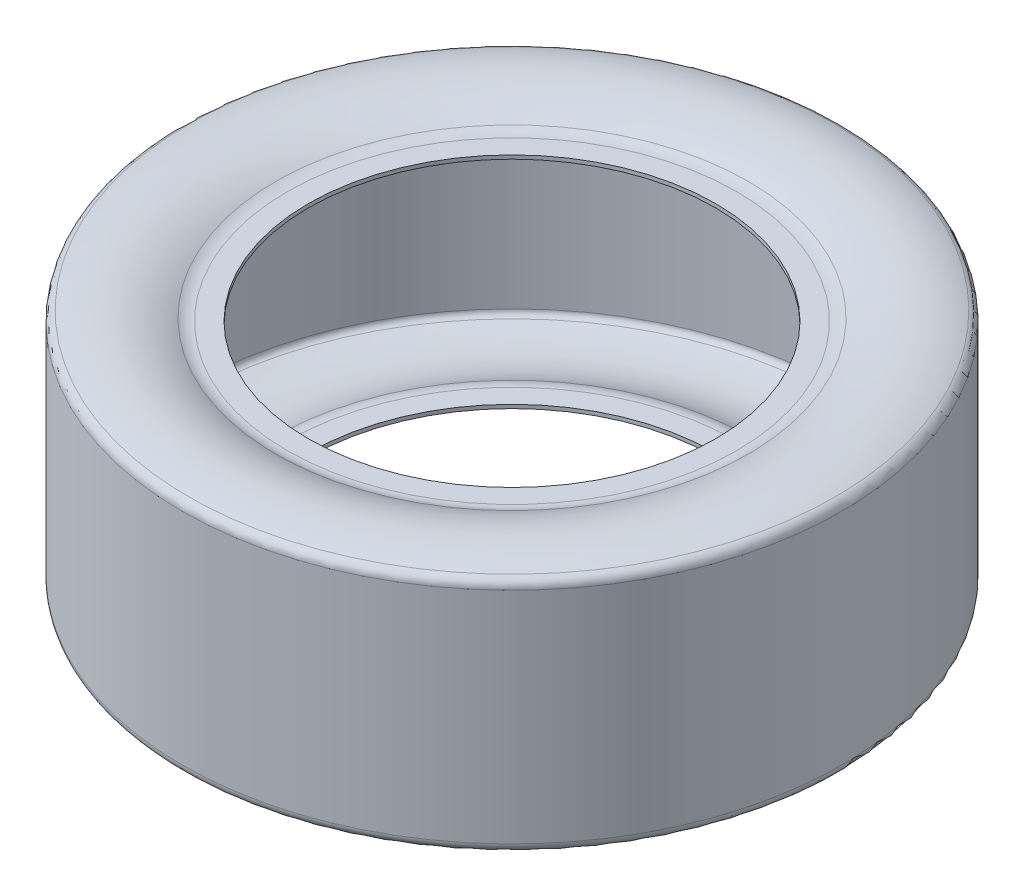
ISO-10303-21;
HEADER;
FILE_DESCRIPTION(('STEP AP214'),'2;1');
FILE_NAME('part.step','',(''),(''),'','','');
FILE_SCHEMA(('AUTOMOTIVE_DESIGN { 1 0 10303 214 1 1 1 1 }'));
ENDSEC;
DATA;
#1=APPLICATION_CONTEXT('core data for automotive mechanical design processes');
#2=APPLICATION_PROTOCOL_DEFINITION('international standard','automotive_design',2000,#1);
#3=PRODUCT_CONTEXT('',#1,'mechanical');
#4=PRODUCT('Part','Part','',(#3));
#5=PRODUCT_RELATED_PRODUCT_CATEGORY('part','',(#4));
#6=PRODUCT_DEFINITION_FORMATION('','',#4);
#7=PRODUCT_DEFINITION_CONTEXT('part definition',#1,'design');
#8=PRODUCT_DEFINITION('design','',#6,#7);
#9=PRODUCT_DEFINITION_SHAPE('','',#8);
#10=(LENGTH_UNIT() NAMED_UNIT(*) SI_UNIT(.MILLI.,.METRE.));
#11=(NAMED_UNIT(*) PLANE_ANGLE_UNIT() SI_UNIT($,.RADIAN.));
#12=(NAMED_UNIT(*) SI_UNIT($,.STERADIAN.) SOLID_ANGLE_UNIT());
#13=UNCERTAINTY_MEASURE_WITH_UNIT(LENGTH_MEASURE(1.E-05),#10,'distance_accuracy_value','');
#14=(GEOMETRIC_REPRESENTATION_CONTEXT(3) GLOBAL_UNCERTAINTY_ASSIGNED_CONTEXT((#13)) GLOBAL_UNIT_ASSIGNED_CONTEXT((#10,
#11,#12)) REPRESENTATION_CONTEXT('',''));
#15=CARTESIAN_POINT('',(0.,0.,0.));
#16=DIRECTION('',(0.,0.,1.));
#17=DIRECTION('',(1.,0.,0.));
#18=AXIS2_PLACEMENT_3D('',#15,#16,#17);
#19=CARTESIAN_POINT('',(0.,-44.45,0.));
#20=DIRECTION('',(0.,1.,0.));
#21=DIRECTION('',(0.,0.,-1.));
#22=AXIS2_PLACEMENT_3D('',#19,#20,#21);
#23=CYLINDRICAL_SURFACE('',#22,263.7);
#24=CARTESIAN_POINT('',(0.,-88.9,0.));
#25=DIRECTION('',(0.,-1.,0.));
#26=DIRECTION('',(0.,0.,-1.));
#27=AXIS2_PLACEMENT_3D('',#24,#25,#26);
#28=CIRCLE('',#27,263.7);
#29=CARTESIAN_POINT('',(0.,-88.9,-263.7));
#30=VERTEX_POINT('',#29);
#31=EDGE_CURVE('E261',#30,#30,#28,.F.);
#32=ORIENTED_EDGE('',*,*,#31,.F.);
#33=EDGE_LOOP('',(#32));
#34=FACE_BOUND('',#33,.T.);
#35=CARTESIAN_POINT('',(0.,88.9,0.));
#36=DIRECTION('',(0.,-1.,0.));
#37=DIRECTION('',(0.,0.,-1.));
#38=AXIS2_PLACEMENT_3D('',#35,#36,#37);
#39=CIRCLE('',#38,263.7);
#40=CARTESIAN_POINT('',(0.,88.9,-263.7));
#41=VERTEX_POINT('',#40);
#42=EDGE_CURVE('E258',#41,#41,#39,.T.);
#43=ORIENTED_EDGE('',*,*,#42,.F.);
#44=EDGE_LOOP('',(#43));
#45=FACE_BOUND('',#44,.T.);
#46=ADVANCED_FACE('F35',(#34,#45),#23,.F.);
#47=CARTESIAN_POINT('',(0.,-88.9,0.));
#48=DIRECTION('',(0.,1.,0.));
#49=DIRECTION('',(0.,0.,-1.));
#50=AXIS2_PLACEMENT_3D('',#47,#48,#49);
#51=TOROIDAL_SURFACE('',#50,258.7,4.99999999999994);
#52=ORIENTED_EDGE('',*,*,#31,.T.);
#53=EDGE_LOOP('',(#52));
#54=FACE_BOUND('',#53,.T.);
#55=CARTESIAN_POINT('',(0.,-93.5989720176161,0.));
#56=DIRECTION('',(0.,-1.,0.));
#57=DIRECTION('',(0.,0.,-1.));
#58=AXIS2_PLACEMENT_3D('',#55,#56,#57);
#59=CIRCLE('',#58,260.408701839895);
#60=CARTESIAN_POINT('',(0.,-93.5989720176161,-260.408701839895));
#61=VERTEX_POINT('',#60);
#62=EDGE_CURVE('E239',#61,#61,#59,.F.);
#63=ORIENTED_EDGE('',*,*,#62,.F.);
#64=EDGE_LOOP('',(#63));
#65=FACE_BOUND('',#64,.T.);
#66=ADVANCED_FACE('F252',(#54,#65),#51,.F.);
#67=CARTESIAN_POINT('',(0.,88.9,0.));
#68=DIRECTION('',(0.,1.,0.));
#69=DIRECTION('',(0.,0.,-1.));
#70=AXIS2_PLACEMENT_3D('',#67,#68,#69);
#71=TOROIDAL_SURFACE('',#70,258.7,4.99999999999994);
#72=CARTESIAN_POINT('',(0.,93.5989720176161,0.));
#73=DIRECTION('',(0.,-1.,0.));
#74=DIRECTION('',(0.,0.,-1.));
#75=AXIS2_PLACEMENT_3D('',#72,#73,#74);
#76=CIRCLE('',#75,260.408701839895);
#77=CARTESIAN_POINT('',(0.,93.5989720176161,-260.408701839895));
#78=VERTEX_POINT('',#77);
#79=EDGE_CURVE('E236',#78,#78,#76,.T.);
#80=ORIENTED_EDGE('',*,*,#79,.F.);
#81=EDGE_LOOP('',(#80));
#82=FACE_BOUND('',#81,.T.);
#83=ORIENTED_EDGE('',*,*,#42,.T.);
#84=EDGE_LOOP('',(#83));
#85=FACE_BOUND('',#84,.T.);
#86=ADVANCED_FACE('F248',(#82,#85),#71,.F.);
#87=CARTESIAN_POINT('',(0.,-15.5341676680611,0.));
#88=DIRECTION('',(0.,1.,0.));
#89=DIRECTION('',(0.,0.,-1.));
#90=AXIS2_PLACEMENT_3D('',#87,#88,#89);
#91=TOROIDAL_SURFACE('',#90,232.021753732297,83.0658323319388);
#92=ORIENTED_EDGE('',*,*,#62,.T.);
#93=EDGE_LOOP('',(#92));
#94=FACE_BOUND('',#93,.T.);
#95=CARTESIAN_POINT('',(0.,-88.6539500098942,0.));
#96=DIRECTION('',(0.,-1.,0.));
#97=DIRECTION('',(0.,0.,-1.));
#98=AXIS2_PLACEMENT_3D('',#95,#96,#97);
#99=CIRCLE('',#98,192.608178262914);
#100=CARTESIAN_POINT('',(0.,-88.6539500098942,-192.608178262914));
#101=VERTEX_POINT('',#100);
#102=EDGE_CURVE('E200',#101,#101,#99,.T.);
#103=ORIENTED_EDGE('',*,*,#102,.T.);
#104=EDGE_LOOP('',(#103));
#105=FACE_BOUND('',#104,.T.);
#106=ADVANCED_FACE('F245',(#94,#105),#91,.F.);
#107=CARTESIAN_POINT('',(0.,15.5341676680611,0.));
#108=DIRECTION('',(0.,1.,0.));
#109=DIRECTION('',(0.,0.,-1.));
#110=AXIS2_PLACEMENT_3D('',#107,#108,#109);
#111=TOROIDAL_SURFACE('',#110,232.021753732297,83.0658323319388);
#112=CARTESIAN_POINT('',(0.,88.6539500098942,0.));
#113=DIRECTION('',(0.,-1.,0.));
#114=DIRECTION('',(0.,0.,-1.));
#115=AXIS2_PLACEMENT_3D('',#112,#113,#114);
#116=CIRCLE('',#115,192.608178262914);
#117=CARTESIAN_POINT('',(0.,88.6539500098942,-192.608178262914));
#118=VERTEX_POINT('',#117);
#119=EDGE_CURVE('E196',#118,#118,#116,.F.);
#120=ORIENTED_EDGE('',*,*,#119,.T.);
#121=EDGE_LOOP('',(#120));
#122=FACE_BOUND('',#121,.T.);
#123=ORIENTED_EDGE('',*,*,#79,.T.);
#124=EDGE_LOOP('',(#123));
#125=FACE_BOUND('',#124,.T.);
#126=ADVANCED_FACE('F220',(#122,#125),#111,.F.);
#127=CARTESIAN_POINT('',(0.,-108.9,0.));
#128=DIRECTION('',(0.,1.,0.));
#129=DIRECTION('',(0.,0.,-1.));
#130=AXIS2_PLACEMENT_3D('',#127,#128,#129);
#131=TOROIDAL_SURFACE('',#130,181.695,23.0000000000001);
#132=ORIENTED_EDGE('',*,*,#102,.F.);
#133=EDGE_LOOP('',(#132));
#134=FACE_BOUND('',#133,.T.);
#135=CARTESIAN_POINT('',(0.,-85.8999999999999,0.));
#136=DIRECTION('',(0.,-1.,0.));
#137=DIRECTION('',(0.,0.,1.));
#138=AXIS2_PLACEMENT_3D('',#135,#136,#137);
#139=CIRCLE('',#138,181.695000000036);
#140=CARTESIAN_POINT('',(0.,-85.8999999999999,181.695000000036));
#141=VERTEX_POINT('',#140);
#142=EDGE_CURVE('E199',#141,#141,#139,.T.);
#143=ORIENTED_EDGE('',*,*,#142,.T.);
#144=EDGE_LOOP('',(#143));
#145=FACE_BOUND('',#144,.T.);
#146=ADVANCED_FACE('F216',(#134,#145),#131,.T.);
#147=CARTESIAN_POINT('',(0.,108.9,0.));
#148=DIRECTION('',(0.,1.,0.));
#149=DIRECTION('',(0.,0.,-1.));
#150=AXIS2_PLACEMENT_3D('',#147,#148,#149);
#151=TOROIDAL_SURFACE('',#150,181.695,23.0000000000001);
#152=CARTESIAN_POINT('',(0.,85.8999999999999,0.));
#153=DIRECTION('',(0.,1.,0.));
#154=DIRECTION('',(0.,0.,1.));
#155=AXIS2_PLACEMENT_3D('',#152,#153,#154);
#156=CIRCLE('',#155,181.695000000036);
#157=CARTESIAN_POINT('',(0.,85.8999999999999,181.695000000036));
#158=VERTEX_POINT('',#157);
#159=EDGE_CURVE('E160',#158,#158,#156,.T.);
#160=ORIENTED_EDGE('',*,*,#159,.T.);
#161=EDGE_LOOP('',(#160));
#162=FACE_BOUND('',#161,.T.);
#163=ORIENTED_EDGE('',*,*,#119,.F.);
#164=EDGE_LOOP('',(#163));
#165=FACE_BOUND('',#164,.T.);
#166=ADVANCED_FACE('F182',(#162,#165),#151,.T.);
#167=CARTESIAN_POINT('',(0.,-85.8999999999999,164.825));
#168=DIRECTION('',(0.,1.,0.));
#169=DIRECTION('',(0.,0.,-1.));
#170=AXIS2_PLACEMENT_3D('',#167,#168,#169);
#171=PLANE('',#170);
#172=CARTESIAN_POINT('',(0.,-85.8999999999999,0.));
#173=DIRECTION('',(0.,-1.,0.));
#174=DIRECTION('',(0.,0.,-1.));
#175=AXIS2_PLACEMENT_3D('',#172,#173,#174);
#176=CIRCLE('',#175,164.825);
#177=CARTESIAN_POINT('',(0.,-85.8999999999999,-164.825));
#178=VERTEX_POINT('',#177);
#179=EDGE_CURVE('E38',#178,#178,#176,.F.);
#180=ORIENTED_EDGE('',*,*,#179,.F.);
#181=EDGE_LOOP('',(#180));
#182=FACE_BOUND('',#181,.T.);
#183=ORIENTED_EDGE('',*,*,#142,.F.);
#184=EDGE_LOOP('',(#183));
#185=FACE_BOUND('',#184,.T.);
#186=ADVANCED_FACE('F177',(#182,#185),#171,.T.);
#187=CARTESIAN_POINT('',(0.,85.9,181.695000000036));
#188=DIRECTION('',(0.,-1.,0.));
#189=DIRECTION('',(0.,0.,1.));
#190=AXIS2_PLACEMENT_3D('',#187,#188,#189);
#191=PLANE('',#190);
#192=CARTESIAN_POINT('',(0.,85.8999999999999,0.));
#193=DIRECTION('',(0.,-1.,0.));
#194=DIRECTION('',(0.,0.,-1.));
#195=AXIS2_PLACEMENT_3D('',#192,#193,#194);
#196=CIRCLE('',#195,164.825);
#197=CARTESIAN_POINT('',(0.,85.8999999999999,-164.825));
#198=VERTEX_POINT('',#197);
#199=EDGE_CURVE('E274',#198,#198,#196,.T.);
#200=ORIENTED_EDGE('',*,*,#199,.F.);
#201=EDGE_LOOP('',(#200));
#202=FACE_BOUND('',#201,.T.);
#203=ORIENTED_EDGE('',*,*,#159,.F.);
#204=EDGE_LOOP('',(#203));
#205=FACE_BOUND('',#204,.T.);
#206=ADVANCED_FACE('F167',(#202,#205),#191,.T.);
#207=CARTESIAN_POINT('',(0.,-87.3999999999999,0.));
#208=DIRECTION('',(0.,1.,0.));
#209=DIRECTION('',(0.,0.,-1.));
#210=AXIS2_PLACEMENT_3D('',#207,#208,#209);
#211=CYLINDRICAL_SURFACE('',#210,164.825);
#212=ORIENTED_EDGE('',*,*,#179,.T.);
#213=EDGE_LOOP('',(#212));
#214=FACE_BOUND('',#213,.T.);
#215=CARTESIAN_POINT('',(0.,-88.9,0.));
#216=DIRECTION('',(0.,-1.,0.));
#217=DIRECTION('',(0.,0.,-1.));
#218=AXIS2_PLACEMENT_3D('',#215,#216,#217);
#219=CIRCLE('',#218,164.825);
#220=CARTESIAN_POINT('',(0.,-88.9,-164.825));
#221=VERTEX_POINT('',#220);
#222=EDGE_CURVE('E272',#221,#221,#219,.T.);
#223=ORIENTED_EDGE('',*,*,#222,.T.);
#224=EDGE_LOOP('',(#223));
#225=FACE_BOUND('',#224,.T.);
#226=ADVANCED_FACE('F176',(#214,#225),#211,.F.);
#227=CARTESIAN_POINT('',(0.,87.3999999999999,0.));
#228=DIRECTION('',(0.,1.,0.));
#229=DIRECTION('',(0.,0.,-1.));
#230=AXIS2_PLACEMENT_3D('',#227,#228,#229);
#231=CYLINDRICAL_SURFACE('',#230,164.825);
#232=CARTESIAN_POINT('',(0.,88.9,0.));
#233=DIRECTION('',(0.,-1.,0.));
#234=DIRECTION('',(0.,0.,-1.));
#235=AXIS2_PLACEMENT_3D('',#232,#233,#234);
#236=CIRCLE('',#235,164.825);
#237=CARTESIAN_POINT('',(0.,88.9,-164.825));
#238=VERTEX_POINT('',#237);
#239=EDGE_CURVE('E269',#238,#238,#236,.F.);
#240=ORIENTED_EDGE('',*,*,#239,.T.);
#241=EDGE_LOOP('',(#240));
#242=FACE_BOUND('',#241,.T.);
#243=ORIENTED_EDGE('',*,*,#199,.T.);
#244=EDGE_LOOP('',(#243));
#245=FACE_BOUND('',#244,.T.);
#246=ADVANCED_FACE('F130',(#242,#245),#231,.F.);
#247=CARTESIAN_POINT('',(0.,-88.9,181.695));
#248=DIRECTION('',(0.,-1.,0.));
#249=DIRECTION('',(0.,0.,1.));
#250=AXIS2_PLACEMENT_3D('',#247,#248,#249);
#251=PLANE('',#250);
#252=ORIENTED_EDGE('',*,*,#222,.F.);
#253=EDGE_LOOP('',(#252));
#254=FACE_BOUND('',#253,.T.);
#255=CARTESIAN_POINT('',(0.,-88.9,0.));
#256=DIRECTION('',(0.,1.,0.));
#257=DIRECTION('',(0.,0.,1.));
#258=AXIS2_PLACEMENT_3D('',#255,#256,#257);
#259=CIRCLE('',#258,181.695);
#260=CARTESIAN_POINT('',(0.,-88.9,181.695));
#261=VERTEX_POINT('',#260);
#262=EDGE_CURVE('E147',#261,#261,#259,.T.);
#263=ORIENTED_EDGE('',*,*,#262,.F.);
#264=EDGE_LOOP('',(#263));
#265=FACE_BOUND('',#264,.T.);
#266=ADVANCED_FACE('F125',(#254,#265),#251,.T.);
#267=CARTESIAN_POINT('',(0.,88.9,164.825));
#268=DIRECTION('',(0.,1.,0.));
#269=DIRECTION('',(0.,0.,-1.));
#270=AXIS2_PLACEMENT_3D('',#267,#268,#269);
#271=PLANE('',#270);
#272=ORIENTED_EDGE('',*,*,#239,.F.);
#273=EDGE_LOOP('',(#272));
#274=FACE_BOUND('',#273,.T.);
#275=CARTESIAN_POINT('',(0.,88.9,0.));
#276=DIRECTION('',(0.,-1.,0.));
#277=DIRECTION('',(0.,0.,1.));
#278=AXIS2_PLACEMENT_3D('',#275,#276,#277);
#279=CIRCLE('',#278,181.695);
#280=CARTESIAN_POINT('',(0.,88.9,181.695));
#281=VERTEX_POINT('',#280);
#282=EDGE_CURVE('E112',#281,#281,#279,.T.);
#283=ORIENTED_EDGE('',*,*,#282,.F.);
#284=EDGE_LOOP('',(#283));
#285=FACE_BOUND('',#284,.T.);
#286=ADVANCED_FACE('F116',(#274,#285),#271,.T.);
#287=CARTESIAN_POINT('',(0.,-108.9,0.));
#288=DIRECTION('',(0.,1.,0.));
#289=DIRECTION('',(0.,0.,-1.));
#290=AXIS2_PLACEMENT_3D('',#287,#288,#289);
#291=TOROIDAL_SURFACE('',#290,181.695,20.);
#292=ORIENTED_EDGE('',*,*,#262,.T.);
#293=EDGE_LOOP('',(#292));
#294=FACE_BOUND('',#293,.T.);
#295=CARTESIAN_POINT('',(0.,-91.2947391390385,0.));
#296=DIRECTION('',(0.,-1.,0.));
#297=DIRECTION('',(0.,0.,-1.));
#298=AXIS2_PLACEMENT_3D('',#295,#296,#297);
#299=CIRCLE('',#298,191.184720228621);
#300=CARTESIAN_POINT('',(0.,-91.2947391390385,-191.184720228621));
#301=VERTEX_POINT('',#300);
#302=EDGE_CURVE('E83',#301,#301,#299,.T.);
#303=ORIENTED_EDGE('',*,*,#302,.T.);
#304=EDGE_LOOP('',(#303));
#305=FACE_BOUND('',#304,.T.);
#306=ADVANCED_FACE('F98',(#294,#305),#291,.F.);
#307=CARTESIAN_POINT('',(0.,108.9,0.));
#308=DIRECTION('',(0.,1.,0.));
#309=DIRECTION('',(0.,0.,-1.));
#310=AXIS2_PLACEMENT_3D('',#307,#308,#309);
#311=TOROIDAL_SURFACE('',#310,181.695,20.);
#312=CARTESIAN_POINT('',(0.,91.2947391390385,0.));
#313=DIRECTION('',(0.,-1.,0.));
#314=DIRECTION('',(0.,0.,-1.));
#315=AXIS2_PLACEMENT_3D('',#312,#313,#314);
#316=CIRCLE('',#315,191.184720228621);
#317=CARTESIAN_POINT('',(0.,91.2947391390385,-191.184720228621));
#318=VERTEX_POINT('',#317);
#319=EDGE_CURVE('E77',#318,#318,#316,.F.);
#320=ORIENTED_EDGE('',*,*,#319,.T.);
#321=EDGE_LOOP('',(#320));
#322=FACE_BOUND('',#321,.T.);
#323=ORIENTED_EDGE('',*,*,#282,.T.);
#324=EDGE_LOOP('',(#323));
#325=FACE_BOUND('',#324,.T.);
#326=ADVANCED_FACE('F92',(#322,#325),#311,.F.);
#327=CARTESIAN_POINT('',(0.,-15.5341676680611,0.));
#328=DIRECTION('',(0.,1.,0.));
#329=DIRECTION('',(0.,0.,-1.));
#330=AXIS2_PLACEMENT_3D('',#327,#328,#329);
#331=TOROIDAL_SURFACE('',#330,232.021753732297,86.0658323319389);
#332=ORIENTED_EDGE('',*,*,#302,.F.);
#333=EDGE_LOOP('',(#332));
#334=FACE_BOUND('',#333,.T.);
#335=CARTESIAN_POINT('',(0.,-96.4183552281858,0.));
#336=DIRECTION('',(0.,-1.,0.));
#337=DIRECTION('',(0.,0.,-1.));
#338=AXIS2_PLACEMENT_3D('',#335,#336,#337);
#339=CIRCLE('',#338,261.433922943832);
#340=CARTESIAN_POINT('',(0.,-96.4183552281858,-261.433922943832));
#341=VERTEX_POINT('',#340);
#342=EDGE_CURVE('E74',#341,#341,#339,.T.);
#343=ORIENTED_EDGE('',*,*,#342,.T.);
#344=EDGE_LOOP('',(#343));
#345=FACE_BOUND('',#344,.T.);
#346=ADVANCED_FACE('F89',(#334,#345),#331,.T.);
#347=CARTESIAN_POINT('',(0.,15.5341676680611,0.));
#348=DIRECTION('',(0.,1.,0.));
#349=DIRECTION('',(0.,0.,-1.));
#350=AXIS2_PLACEMENT_3D('',#347,#348,#349);
#351=TOROIDAL_SURFACE('',#350,232.021753732297,86.0658323319389);
#352=CARTESIAN_POINT('',(0.,96.4183552281858,0.));
#353=DIRECTION('',(0.,-1.,0.));
#354=DIRECTION('',(0.,0.,-1.));
#355=AXIS2_PLACEMENT_3D('',#352,#353,#354);
#356=CIRCLE('',#355,261.433922943832);
#357=CARTESIAN_POINT('',(0.,96.4183552281858,-261.433922943832));
#358=VERTEX_POINT('',#357);
#359=EDGE_CURVE('E47',#358,#358,#356,.F.);
#360=ORIENTED_EDGE('',*,*,#359,.T.);
#361=EDGE_LOOP('',(#360));
#362=FACE_BOUND('',#361,.T.);
#363=ORIENTED_EDGE('',*,*,#319,.F.);
#364=EDGE_LOOP('',(#363));
#365=FACE_BOUND('',#364,.T.);
#366=ADVANCED_FACE('F67',(#362,#365),#351,.T.);
#367=CARTESIAN_POINT('',(0.,-88.9,0.));
#368=DIRECTION('',(0.,1.,0.));
#369=DIRECTION('',(0.,0.,-1.));
#370=AXIS2_PLACEMENT_3D('',#367,#368,#369);
#371=TOROIDAL_SURFACE('',#370,258.7,8.);
#372=ORIENTED_EDGE('',*,*,#342,.F.);
#373=EDGE_LOOP('',(#372));
#374=FACE_BOUND('',#373,.T.);
#375=CARTESIAN_POINT('',(0.,-88.9,0.));
#376=DIRECTION('',(0.,-1.,0.));
#377=DIRECTION('',(0.,0.,-1.));
#378=AXIS2_PLACEMENT_3D('',#375,#376,#377);
#379=CIRCLE('',#378,266.7);
#380=CARTESIAN_POINT('',(0.,-88.9,-266.7));
#381=VERTEX_POINT('',#380);
#382=EDGE_CURVE('E42',#381,#381,#379,.T.);
#383=ORIENTED_EDGE('',*,*,#382,.T.);
#384=EDGE_LOOP('',(#383));
#385=FACE_BOUND('',#384,.T.);
#386=ADVANCED_FACE('F63',(#374,#385),#371,.T.);
#387=CARTESIAN_POINT('',(0.,88.9,0.));
#388=DIRECTION('',(0.,1.,0.));
#389=DIRECTION('',(0.,0.,-1.));
#390=AXIS2_PLACEMENT_3D('',#387,#388,#389);
#391=TOROIDAL_SURFACE('',#390,258.7,8.);
#392=CARTESIAN_POINT('',(0.,88.9,0.));
#393=DIRECTION('',(0.,-1.,0.));
#394=DIRECTION('',(0.,0.,-1.));
#395=AXIS2_PLACEMENT_3D('',#392,#393,#394);
#396=CIRCLE('',#395,266.7);
#397=CARTESIAN_POINT('',(0.,88.9,-266.7));
#398=VERTEX_POINT('',#397);
#399=EDGE_CURVE('E10',#398,#398,#396,.F.);
#400=ORIENTED_EDGE('',*,*,#399,.T.);
#401=EDGE_LOOP('',(#400));
#402=FACE_BOUND('',#401,.T.);
#403=ORIENTED_EDGE('',*,*,#359,.F.);
#404=EDGE_LOOP('',(#403));
#405=FACE_BOUND('',#404,.T.);
#406=ADVANCED_FACE('F58',(#402,#405),#391,.T.);
#407=CARTESIAN_POINT('',(0.,44.45,0.));
#408=DIRECTION('',(0.,1.,0.));
#409=DIRECTION('',(0.,0.,-1.));
#410=AXIS2_PLACEMENT_3D('',#407,#408,#409);
#411=CYLINDRICAL_SURFACE('',#410,266.7);
#412=ORIENTED_EDGE('',*,*,#399,.F.);
#413=EDGE_LOOP('',(#412));
#414=FACE_BOUND('',#413,.T.);
#415=ORIENTED_EDGE('',*,*,#382,.F.);
#416=EDGE_LOOP('',(#415));
#417=FACE_BOUND('',#416,.T.);
#418=ADVANCED_FACE('F62',(#414,#417),#411,.T.);
#419=CLOSED_SHELL('',(#46,#66,#86,#106,#126,#146,#166,#186,#206,#226,#246,#266,#286,#306,#326,
#346,#366,#386,#406,#418));
#420=MANIFOLD_SOLID_BREP('B2',#419);
#421=ADVANCED_BREP_SHAPE_REPRESENTATION('',(#18,#420),#14);
#422=SHAPE_DEFINITION_REPRESENTATION(#9,#421);
ENDSEC;
END-ISO-10303-21;
